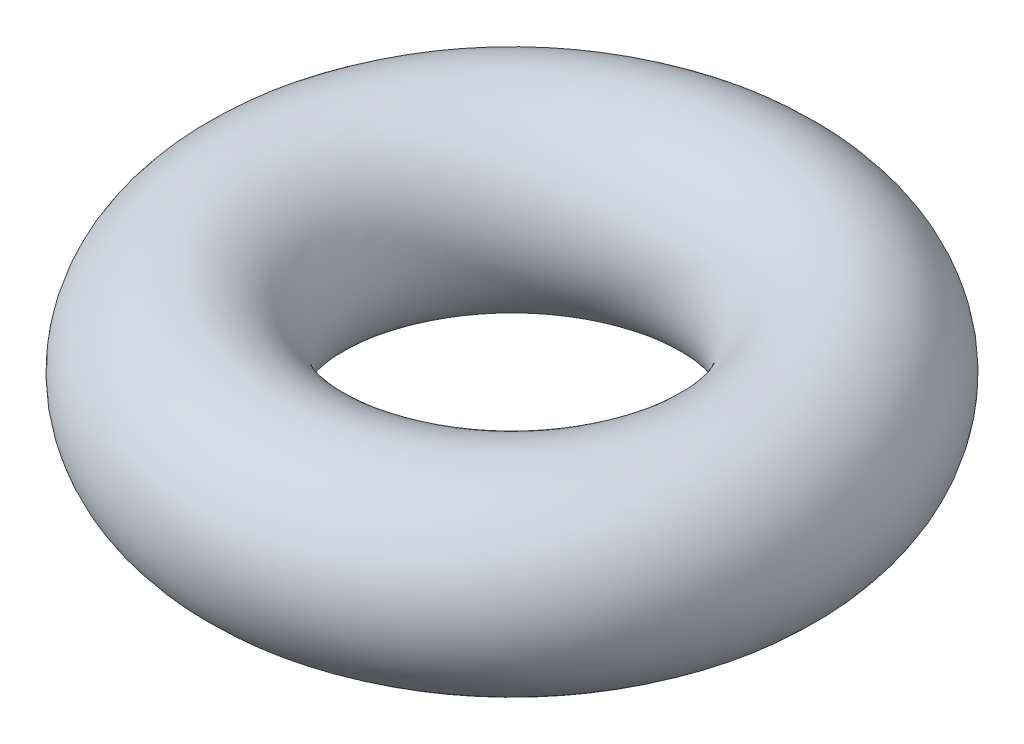
ISO-10303-21;
HEADER;
FILE_DESCRIPTION(('STEP AP214'),'2;1');
FILE_NAME('part.step','',(''),(''),'','','');
FILE_SCHEMA(('AUTOMOTIVE_DESIGN { 1 0 10303 214 1 1 1 1 }'));
ENDSEC;
DATA;
#1=APPLICATION_CONTEXT('core data for automotive mechanical design processes');
#2=APPLICATION_PROTOCOL_DEFINITION('international standard','automotive_design',2000,#1);
#3=PRODUCT_CONTEXT('',#1,'mechanical');
#4=PRODUCT('Part','Part','',(#3));
#5=PRODUCT_RELATED_PRODUCT_CATEGORY('part','',(#4));
#6=PRODUCT_DEFINITION_FORMATION('','',#4);
#7=PRODUCT_DEFINITION_CONTEXT('part definition',#1,'design');
#8=PRODUCT_DEFINITION('design','',#6,#7);
#9=PRODUCT_DEFINITION_SHAPE('','',#8);
#10=(LENGTH_UNIT() NAMED_UNIT(*) SI_UNIT(.MILLI.,.METRE.));
#11=(NAMED_UNIT(*) PLANE_ANGLE_UNIT() SI_UNIT($,.RADIAN.));
#12=(NAMED_UNIT(*) SI_UNIT($,.STERADIAN.) SOLID_ANGLE_UNIT());
#13=UNCERTAINTY_MEASURE_WITH_UNIT(LENGTH_MEASURE(1.E-05),#10,'distance_accuracy_value','');
#14=(GEOMETRIC_REPRESENTATION_CONTEXT(3) GLOBAL_UNCERTAINTY_ASSIGNED_CONTEXT((#13)) GLOBAL_UNIT_ASSIGNED_CONTEXT((#10,
#11,#12)) REPRESENTATION_CONTEXT('',''));
#15=CARTESIAN_POINT('',(0.,0.,0.));
#16=DIRECTION('',(0.,0.,1.));
#17=DIRECTION('',(1.,0.,0.));
#18=AXIS2_PLACEMENT_3D('',#15,#16,#17);
#19=CARTESIAN_POINT('',(0.,0.,0.));
#20=DIRECTION('',(0.,-1.,0.));
#21=DIRECTION('',(0.,0.,-1.));
#22=AXIS2_PLACEMENT_3D('',#19,#20,#21);
#23=TOROIDAL_SURFACE('',#22,2.5,1.);
#24=CARTESIAN_POINT('',(0.,0.,-3.5));
#25=VERTEX_POINT('',#24);
#26=VERTEX_LOOP('',#25);
#27=FACE_BOUND('',#26,.T.);
#28=ADVANCED_FACE('F33',(#27),#23,.T.);
#29=CLOSED_SHELL('',(#28));
#30=MANIFOLD_SOLID_BREP('B2',#29);
#31=ADVANCED_BREP_SHAPE_REPRESENTATION('',(#18,#30),#14);
#32=SHAPE_DEFINITION_REPRESENTATION(#9,#31);
ENDSEC;
END-ISO-10303-21;
